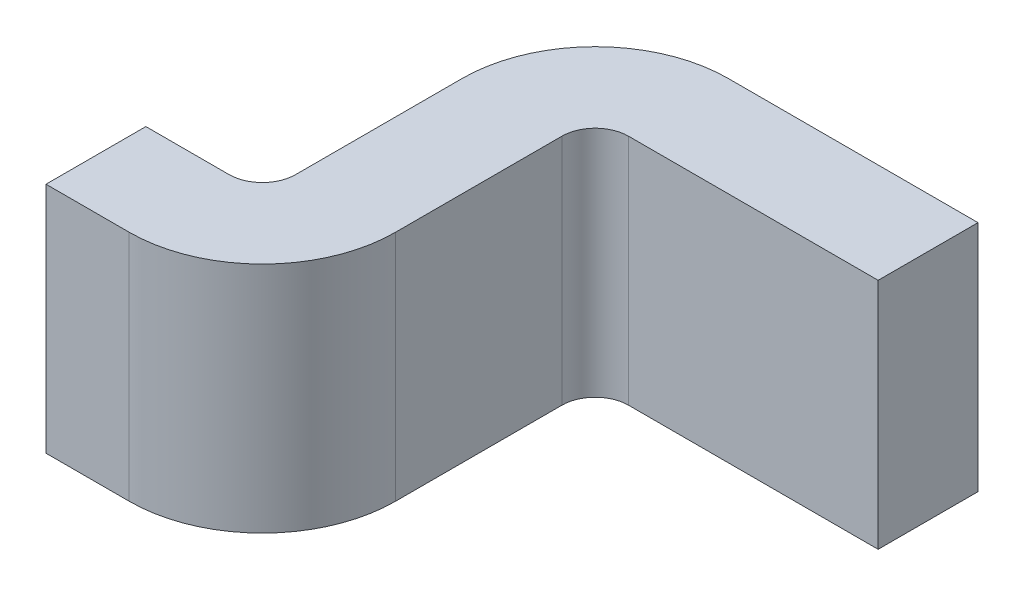
ISO-10303-21;
HEADER;
FILE_DESCRIPTION(('STEP AP214'),'2;1');
FILE_NAME('part.step','',(''),(''),'','','');
FILE_SCHEMA(('AUTOMOTIVE_DESIGN { 1 0 10303 214 1 1 1 1 }'));
ENDSEC;
DATA;
#1=APPLICATION_CONTEXT('core data for automotive mechanical design processes');
#2=APPLICATION_PROTOCOL_DEFINITION('international standard','automotive_design',2000,#1);
#3=PRODUCT_CONTEXT('',#1,'mechanical');
#4=PRODUCT('Part','Part','',(#3));
#5=PRODUCT_RELATED_PRODUCT_CATEGORY('part','',(#4));
#6=PRODUCT_DEFINITION_FORMATION('','',#4);
#7=PRODUCT_DEFINITION_CONTEXT('part definition',#1,'design');
#8=PRODUCT_DEFINITION('design','',#6,#7);
#9=PRODUCT_DEFINITION_SHAPE('','',#8);
#10=(LENGTH_UNIT() NAMED_UNIT(*) SI_UNIT(.MILLI.,.METRE.));
#11=(NAMED_UNIT(*) PLANE_ANGLE_UNIT() SI_UNIT($,.RADIAN.));
#12=(NAMED_UNIT(*) SI_UNIT($,.STERADIAN.) SOLID_ANGLE_UNIT());
#13=UNCERTAINTY_MEASURE_WITH_UNIT(LENGTH_MEASURE(1.E-05),#10,'distance_accuracy_value','');
#14=(GEOMETRIC_REPRESENTATION_CONTEXT(3) GLOBAL_UNCERTAINTY_ASSIGNED_CONTEXT((#13)) GLOBAL_UNIT_ASSIGNED_CONTEXT((#10,
#11,#12)) REPRESENTATION_CONTEXT('',''));
#15=CARTESIAN_POINT('',(0.,0.,0.));
#16=DIRECTION('',(0.,0.,1.));
#17=DIRECTION('',(1.,0.,0.));
#18=AXIS2_PLACEMENT_3D('',#15,#16,#17);
#19=CARTESIAN_POINT('',(4.075,-1.9082188291665,0.));
#20=DIRECTION('',(0.,1.,0.));
#21=DIRECTION('',(-1.,0.,0.));
#22=AXIS2_PLACEMENT_3D('',#19,#20,#21);
#23=PLANE('',#22);
#24=DIRECTION('',(-1.,0.,0.));
#25=VECTOR('',#24,1.);
#26=CARTESIAN_POINT('',(0.,-1.9082188291665,0.));
#27=LINE('',#26,#25);
#28=CARTESIAN_POINT('',(3.75,-1.9082188291665,0.));
#29=VERTEX_POINT('',#28);
#30=CARTESIAN_POINT('',(4.5,-1.9082188291665,0.));
#31=VERTEX_POINT('',#30);
#32=EDGE_CURVE('E134',#29,#31,#27,.F.);
#33=ORIENTED_EDGE('',*,*,#32,.F.);
#34=CARTESIAN_POINT('',(3.75,-1.9082188291665,0.4));
#35=DIRECTION('',(0.,-1.,0.));
#36=DIRECTION('',(1.,0.,0.));
#37=AXIS2_PLACEMENT_3D('',#34,#35,#36);
#38=CIRCLE('',#37,0.4);
#39=CARTESIAN_POINT('',(3.35,-1.9082188291665,0.4));
#40=VERTEX_POINT('',#39);
#41=EDGE_CURVE('E182',#40,#29,#38,.T.);
#42=ORIENTED_EDGE('',*,*,#41,.F.);
#43=DIRECTION('',(0.,0.,1.));
#44=VECTOR('',#43,1.);
#45=CARTESIAN_POINT('',(3.35,-1.9082188291665,0.));
#46=LINE('',#45,#44);
#47=CARTESIAN_POINT('',(3.35,-1.9082188291665,0.9));
#48=VERTEX_POINT('',#47);
#49=EDGE_CURVE('E140',#48,#40,#46,.F.);
#50=ORIENTED_EDGE('',*,*,#49,.F.);
#51=CARTESIAN_POINT('',(3.25,-1.9082188291665,0.9));
#52=DIRECTION('',(0.,1.,0.));
#53=DIRECTION('',(-1.,0.,0.));
#54=AXIS2_PLACEMENT_3D('',#51,#52,#53);
#55=CIRCLE('',#54,0.1);
#56=CARTESIAN_POINT('',(3.25,-1.9082188291665,1.));
#57=VERTEX_POINT('',#56);
#58=EDGE_CURVE('E185',#48,#57,#55,.F.);
#59=ORIENTED_EDGE('',*,*,#58,.T.);
#60=DIRECTION('',(1.,0.,0.));
#61=VECTOR('',#60,1.);
#62=CARTESIAN_POINT('',(3.5,-1.9082188291665,1.));
#63=LINE('',#62,#61);
#64=CARTESIAN_POINT('',(3.,-1.9082188291665,1.));
#65=VERTEX_POINT('',#64);
#66=EDGE_CURVE('E144',#57,#65,#63,.F.);
#67=ORIENTED_EDGE('',*,*,#66,.T.);
#68=DIRECTION('',(0.,0.,1.));
#69=VECTOR('',#68,1.);
#70=CARTESIAN_POINT('',(3.,-1.9082188291665,1.));
#71=LINE('',#70,#69);
#72=CARTESIAN_POINT('',(3.,-1.9082188291665,1.3));
#73=VERTEX_POINT('',#72);
#74=EDGE_CURVE('E148',#73,#65,#71,.F.);
#75=ORIENTED_EDGE('',*,*,#74,.F.);
#76=DIRECTION('',(1.,0.,0.));
#77=VECTOR('',#76,1.);
#78=CARTESIAN_POINT('',(3.65,-1.9082188291665,1.3));
#79=LINE('',#78,#77);
#80=CARTESIAN_POINT('',(3.25,-1.9082188291665,1.3));
#81=VERTEX_POINT('',#80);
#82=EDGE_CURVE('E156',#81,#73,#79,.F.);
#83=ORIENTED_EDGE('',*,*,#82,.F.);
#84=CARTESIAN_POINT('',(3.25,-1.9082188291665,0.9));
#85=DIRECTION('',(0.,-1.,0.));
#86=DIRECTION('',(1.,0.,0.));
#87=AXIS2_PLACEMENT_3D('',#84,#85,#86);
#88=CIRCLE('',#87,0.4);
#89=CARTESIAN_POINT('',(3.65,-1.9082188291665,0.9));
#90=VERTEX_POINT('',#89);
#91=EDGE_CURVE('E187',#90,#81,#88,.T.);
#92=ORIENTED_EDGE('',*,*,#91,.F.);
#93=DIRECTION('',(0.,0.,1.));
#94=VECTOR('',#93,1.);
#95=CARTESIAN_POINT('',(3.65,-1.9082188291665,0.15));
#96=LINE('',#95,#94);
#97=CARTESIAN_POINT('',(3.65,-1.9082188291665,0.4));
#98=VERTEX_POINT('',#97);
#99=EDGE_CURVE('E162',#90,#98,#96,.F.);
#100=ORIENTED_EDGE('',*,*,#99,.T.);
#101=CARTESIAN_POINT('',(3.75,-1.9082188291665,0.4));
#102=DIRECTION('',(0.,-1.,0.));
#103=DIRECTION('',(1.,0.,0.));
#104=AXIS2_PLACEMENT_3D('',#101,#102,#103);
#105=CIRCLE('',#104,0.1);
#106=CARTESIAN_POINT('',(3.75,-1.9082188291665,0.3));
#107=VERTEX_POINT('',#106);
#108=EDGE_CURVE('E20',#98,#107,#105,.T.);
#109=ORIENTED_EDGE('',*,*,#108,.T.);
#110=DIRECTION('',(-1.,0.,0.));
#111=VECTOR('',#110,1.);
#112=CARTESIAN_POINT('',(0.,-1.9082188291665,0.3));
#113=LINE('',#112,#111);
#114=CARTESIAN_POINT('',(4.5,-1.9082188291665,0.3));
#115=VERTEX_POINT('',#114);
#116=EDGE_CURVE('E92',#107,#115,#113,.F.);
#117=ORIENTED_EDGE('',*,*,#116,.T.);
#118=DIRECTION('',(0.,0.,1.));
#119=VECTOR('',#118,1.);
#120=CARTESIAN_POINT('',(4.5,-1.9082188291665,0.));
#121=LINE('',#120,#119);
#122=EDGE_CURVE('E112',#31,#115,#121,.T.);
#123=ORIENTED_EDGE('',*,*,#122,.F.);
#124=EDGE_LOOP('',(#33,#42,#50,#59,#67,#75,#83,#92,#100,#109,#117,#123));
#125=FACE_BOUND('',#124,.T.);
#126=ADVANCED_FACE('F17',(#125),#23,.T.);
#127=CARTESIAN_POINT('',(0.,-0.0164376583329882,0.));
#128=DIRECTION('',(0.,0.,-1.));
#129=DIRECTION('',(-1.,0.,0.));
#130=AXIS2_PLACEMENT_3D('',#127,#128,#129);
#131=PLANE('',#130);
#132=DIRECTION('',(0.,1.,0.));
#133=VECTOR('',#132,1.);
#134=CARTESIAN_POINT('',(4.5,-2.2582188291665,0.));
#135=LINE('',#134,#133);
#136=CARTESIAN_POINT('',(4.5,-2.6082188291665,0.));
#137=VERTEX_POINT('',#136);
#138=EDGE_CURVE('E101',#137,#31,#135,.T.);
#139=ORIENTED_EDGE('',*,*,#138,.F.);
#140=DIRECTION('',(1.,0.,0.));
#141=VECTOR('',#140,1.);
#142=CARTESIAN_POINT('',(4.075,-2.6082188291665,0.));
#143=LINE('',#142,#141);
#144=CARTESIAN_POINT('',(3.75,-2.6082188291665,0.));
#145=VERTEX_POINT('',#144);
#146=EDGE_CURVE('E125',#145,#137,#143,.T.);
#147=ORIENTED_EDGE('',*,*,#146,.F.);
#148=DIRECTION('',(0.,1.,0.));
#149=VECTOR('',#148,1.);
#150=CARTESIAN_POINT('',(3.75,-0.0164376583329882,0.));
#151=LINE('',#150,#149);
#152=EDGE_CURVE('E137',#145,#29,#151,.T.);
#153=ORIENTED_EDGE('',*,*,#152,.T.);
#154=ORIENTED_EDGE('',*,*,#32,.T.);
#155=EDGE_LOOP('',(#139,#147,#153,#154));
#156=FACE_BOUND('',#155,.T.);
#157=ADVANCED_FACE('F381',(#156),#131,.T.);
#158=CARTESIAN_POINT('',(4.5,-2.2582188291665,0.));
#159=DIRECTION('',(1.,0.,0.));
#160=DIRECTION('',(0.,1.,0.));
#161=AXIS2_PLACEMENT_3D('',#158,#159,#160);
#162=PLANE('',#161);
#163=ORIENTED_EDGE('',*,*,#138,.T.);
#164=ORIENTED_EDGE('',*,*,#122,.T.);
#165=DIRECTION('',(0.,1.,0.));
#166=VECTOR('',#165,1.);
#167=CARTESIAN_POINT('',(4.5,-0.0164376583329882,0.3));
#168=LINE('',#167,#166);
#169=CARTESIAN_POINT('',(4.5,-2.6082188291665,0.3));
#170=VERTEX_POINT('',#169);
#171=EDGE_CURVE('E106',#115,#170,#168,.F.);
#172=ORIENTED_EDGE('',*,*,#171,.T.);
#173=DIRECTION('',(0.,0.,1.));
#174=VECTOR('',#173,1.);
#175=CARTESIAN_POINT('',(4.5,-2.6082188291665,0.));
#176=LINE('',#175,#174);
#177=EDGE_CURVE('E110',#137,#170,#176,.T.);
#178=ORIENTED_EDGE('',*,*,#177,.F.);
#179=EDGE_LOOP('',(#163,#164,#172,#178));
#180=FACE_BOUND('',#179,.T.);
#181=ADVANCED_FACE('F108',(#180),#162,.T.);
#182=CARTESIAN_POINT('',(0.,-0.0164376583329882,0.3));
#183=DIRECTION('',(0.,0.,-1.));
#184=DIRECTION('',(-1.,0.,0.));
#185=AXIS2_PLACEMENT_3D('',#182,#183,#184);
#186=PLANE('',#185);
#187=DIRECTION('',(1.,0.,0.));
#188=VECTOR('',#187,1.);
#189=CARTESIAN_POINT('',(4.075,-2.6082188291665,0.3));
#190=LINE('',#189,#188);
#191=CARTESIAN_POINT('',(3.75,-2.6082188291665,0.3));
#192=VERTEX_POINT('',#191);
#193=EDGE_CURVE('E117',#170,#192,#190,.F.);
#194=ORIENTED_EDGE('',*,*,#193,.F.);
#195=ORIENTED_EDGE('',*,*,#171,.F.);
#196=ORIENTED_EDGE('',*,*,#116,.F.);
#197=DIRECTION('',(0.,-1.,0.));
#198=VECTOR('',#197,1.);
#199=CARTESIAN_POINT('',(3.75,-1.13732824374975,0.3));
#200=LINE('',#199,#198);
#201=EDGE_CURVE('E114',#107,#192,#200,.T.);
#202=ORIENTED_EDGE('',*,*,#201,.T.);
#203=EDGE_LOOP('',(#194,#195,#196,#202));
#204=FACE_BOUND('',#203,.T.);
#205=ADVANCED_FACE('F118',(#204),#186,.F.);
#206=CARTESIAN_POINT('',(3.75,-1.13732824374975,0.4));
#207=DIRECTION('',(0.,-1.,0.));
#208=DIRECTION('',(1.,0.,0.));
#209=AXIS2_PLACEMENT_3D('',#206,#207,#208);
#210=CYLINDRICAL_SURFACE('',#209,0.1);
#211=ORIENTED_EDGE('',*,*,#108,.F.);
#212=DIRECTION('',(0.,-1.,0.));
#213=VECTOR('',#212,1.);
#214=CARTESIAN_POINT('',(3.65,-2.2582188291665,0.4));
#215=LINE('',#214,#213);
#216=CARTESIAN_POINT('',(3.65,-2.6082188291665,0.4));
#217=VERTEX_POINT('',#216);
#218=EDGE_CURVE('E164',#98,#217,#215,.T.);
#219=ORIENTED_EDGE('',*,*,#218,.T.);
#220=CARTESIAN_POINT('',(3.75,-2.6082188291665,0.4));
#221=DIRECTION('',(0.,-1.,0.));
#222=DIRECTION('',(1.,0.,0.));
#223=AXIS2_PLACEMENT_3D('',#220,#221,#222);
#224=CIRCLE('',#223,0.1);
#225=EDGE_CURVE('E122',#192,#217,#224,.F.);
#226=ORIENTED_EDGE('',*,*,#225,.F.);
#227=ORIENTED_EDGE('',*,*,#201,.F.);
#228=EDGE_LOOP('',(#211,#219,#226,#227));
#229=FACE_BOUND('',#228,.T.);
#230=ADVANCED_FACE('F262',(#229),#210,.F.);
#231=CARTESIAN_POINT('',(3.65,-2.2582188291665,0.15));
#232=DIRECTION('',(-1.,0.,0.));
#233=DIRECTION('',(0.,-1.,0.));
#234=AXIS2_PLACEMENT_3D('',#231,#232,#233);
#235=PLANE('',#234);
#236=ORIENTED_EDGE('',*,*,#99,.F.);
#237=DIRECTION('',(0.,-1.,0.));
#238=VECTOR('',#237,1.);
#239=CARTESIAN_POINT('',(3.65,-2.2582188291665,0.9));
#240=LINE('',#239,#238);
#241=CARTESIAN_POINT('',(3.65,-2.6082188291665,0.9));
#242=VERTEX_POINT('',#241);
#243=EDGE_CURVE('E188',#242,#90,#240,.F.);
#244=ORIENTED_EDGE('',*,*,#243,.F.);
#245=DIRECTION('',(0.,0.,1.));
#246=VECTOR('',#245,1.);
#247=CARTESIAN_POINT('',(3.65,-2.6082188291665,0.));
#248=LINE('',#247,#246);
#249=EDGE_CURVE('E179',#217,#242,#248,.T.);
#250=ORIENTED_EDGE('',*,*,#249,.F.);
#251=ORIENTED_EDGE('',*,*,#218,.F.);
#252=EDGE_LOOP('',(#236,#244,#250,#251));
#253=FACE_BOUND('',#252,.T.);
#254=ADVANCED_FACE('F254',(#253),#235,.F.);
#255=CARTESIAN_POINT('',(3.25,-2.2582188291665,0.9));
#256=DIRECTION('',(0.,-1.,0.));
#257=DIRECTION('',(1.,0.,0.));
#258=AXIS2_PLACEMENT_3D('',#255,#256,#257);
#259=CYLINDRICAL_SURFACE('',#258,0.4);
#260=DIRECTION('',(0.,1.,0.));
#261=VECTOR('',#260,1.);
#262=CARTESIAN_POINT('',(3.25,-2.2582188291665,1.3));
#263=LINE('',#262,#261);
#264=CARTESIAN_POINT('',(3.25,-2.6082188291665,1.3));
#265=VERTEX_POINT('',#264);
#266=EDGE_CURVE('E159',#265,#81,#263,.T.);
#267=ORIENTED_EDGE('',*,*,#266,.F.);
#268=CARTESIAN_POINT('',(3.25,-2.6082188291665,0.9));
#269=DIRECTION('',(0.,-1.,0.));
#270=DIRECTION('',(1.,0.,0.));
#271=AXIS2_PLACEMENT_3D('',#268,#269,#270);
#272=CIRCLE('',#271,0.4);
#273=EDGE_CURVE('E176',#242,#265,#272,.T.);
#274=ORIENTED_EDGE('',*,*,#273,.F.);
#275=ORIENTED_EDGE('',*,*,#243,.T.);
#276=ORIENTED_EDGE('',*,*,#91,.T.);
#277=EDGE_LOOP('',(#267,#274,#275,#276));
#278=FACE_BOUND('',#277,.T.);
#279=ADVANCED_FACE('F252',(#278),#259,.T.);
#280=CARTESIAN_POINT('',(3.65,-2.2582188291665,1.3));
#281=DIRECTION('',(0.,0.,1.));
#282=DIRECTION('',(1.,0.,0.));
#283=AXIS2_PLACEMENT_3D('',#280,#281,#282);
#284=PLANE('',#283);
#285=DIRECTION('',(0.,-1.,0.));
#286=VECTOR('',#285,1.);
#287=CARTESIAN_POINT('',(3.,-2.2582188291665,1.3));
#288=LINE('',#287,#286);
#289=CARTESIAN_POINT('',(3.,-2.6082188291665,1.3));
#290=VERTEX_POINT('',#289);
#291=EDGE_CURVE('E153',#290,#73,#288,.F.);
#292=ORIENTED_EDGE('',*,*,#291,.F.);
#293=DIRECTION('',(1.,0.,0.));
#294=VECTOR('',#293,1.);
#295=CARTESIAN_POINT('',(4.075,-2.6082188291665,1.3));
#296=LINE('',#295,#294);
#297=EDGE_CURVE('E178',#265,#290,#296,.F.);
#298=ORIENTED_EDGE('',*,*,#297,.F.);
#299=ORIENTED_EDGE('',*,*,#266,.T.);
#300=ORIENTED_EDGE('',*,*,#82,.T.);
#301=EDGE_LOOP('',(#292,#298,#299,#300));
#302=FACE_BOUND('',#301,.T.);
#303=ADVANCED_FACE('F247',(#302),#284,.T.);
#304=CARTESIAN_POINT('',(3.,-2.2582188291665,1.));
#305=DIRECTION('',(-1.,0.,0.));
#306=DIRECTION('',(0.,-1.,0.));
#307=AXIS2_PLACEMENT_3D('',#304,#305,#306);
#308=PLANE('',#307);
#309=DIRECTION('',(0.,1.,0.));
#310=VECTOR('',#309,1.);
#311=CARTESIAN_POINT('',(3.,-2.2582188291665,1.));
#312=LINE('',#311,#310);
#313=CARTESIAN_POINT('',(3.,-2.6082188291665,1.));
#314=VERTEX_POINT('',#313);
#315=EDGE_CURVE('E147',#65,#314,#312,.F.);
#316=ORIENTED_EDGE('',*,*,#315,.T.);
#317=DIRECTION('',(0.,0.,1.));
#318=VECTOR('',#317,1.);
#319=CARTESIAN_POINT('',(3.,-2.6082188291665,0.));
#320=LINE('',#319,#318);
#321=EDGE_CURVE('E207',#290,#314,#320,.F.);
#322=ORIENTED_EDGE('',*,*,#321,.F.);
#323=ORIENTED_EDGE('',*,*,#291,.T.);
#324=ORIENTED_EDGE('',*,*,#74,.T.);
#325=EDGE_LOOP('',(#316,#322,#323,#324));
#326=FACE_BOUND('',#325,.T.);
#327=ADVANCED_FACE('F250',(#326),#308,.T.);
#328=CARTESIAN_POINT('',(3.5,-2.2582188291665,1.));
#329=DIRECTION('',(0.,0.,1.));
#330=DIRECTION('',(1.,0.,0.));
#331=AXIS2_PLACEMENT_3D('',#328,#329,#330);
#332=PLANE('',#331);
#333=DIRECTION('',(1.,0.,0.));
#334=VECTOR('',#333,1.);
#335=CARTESIAN_POINT('',(4.075,-2.6082188291665,1.));
#336=LINE('',#335,#334);
#337=CARTESIAN_POINT('',(3.25,-2.6082188291665,1.));
#338=VERTEX_POINT('',#337);
#339=EDGE_CURVE('E175',#314,#338,#336,.T.);
#340=ORIENTED_EDGE('',*,*,#339,.F.);
#341=ORIENTED_EDGE('',*,*,#315,.F.);
#342=ORIENTED_EDGE('',*,*,#66,.F.);
#343=DIRECTION('',(0.,1.,0.));
#344=VECTOR('',#343,1.);
#345=CARTESIAN_POINT('',(3.25,-2.2582188291665,1.));
#346=LINE('',#345,#344);
#347=EDGE_CURVE('E186',#57,#338,#346,.F.);
#348=ORIENTED_EDGE('',*,*,#347,.T.);
#349=EDGE_LOOP('',(#340,#341,#342,#348));
#350=FACE_BOUND('',#349,.T.);
#351=ADVANCED_FACE('F237',(#350),#332,.F.);
#352=CARTESIAN_POINT('',(3.25,-2.2582188291665,0.9));
#353=DIRECTION('',(0.,1.,0.));
#354=DIRECTION('',(-1.,0.,0.));
#355=AXIS2_PLACEMENT_3D('',#352,#353,#354);
#356=CYLINDRICAL_SURFACE('',#355,0.1);
#357=ORIENTED_EDGE('',*,*,#58,.F.);
#358=DIRECTION('',(0.,-1.,0.));
#359=VECTOR('',#358,1.);
#360=CARTESIAN_POINT('',(3.35,-2.2582188291665,0.9));
#361=LINE('',#360,#359);
#362=CARTESIAN_POINT('',(3.35,-2.6082188291665,0.9));
#363=VERTEX_POINT('',#362);
#364=EDGE_CURVE('E143',#363,#48,#361,.F.);
#365=ORIENTED_EDGE('',*,*,#364,.F.);
#366=CARTESIAN_POINT('',(3.25,-2.6082188291665,0.9));
#367=DIRECTION('',(0.,1.,0.));
#368=DIRECTION('',(-1.,0.,0.));
#369=AXIS2_PLACEMENT_3D('',#366,#367,#368);
#370=CIRCLE('',#369,0.1);
#371=EDGE_CURVE('E26',#338,#363,#370,.T.);
#372=ORIENTED_EDGE('',*,*,#371,.F.);
#373=ORIENTED_EDGE('',*,*,#347,.F.);
#374=EDGE_LOOP('',(#357,#365,#372,#373));
#375=FACE_BOUND('',#374,.T.);
#376=ADVANCED_FACE('F276',(#375),#356,.F.);
#377=CARTESIAN_POINT('',(3.35,-2.2582188291665,0.));
#378=DIRECTION('',(-1.,0.,0.));
#379=DIRECTION('',(0.,-1.,0.));
#380=AXIS2_PLACEMENT_3D('',#377,#378,#379);
#381=PLANE('',#380);
#382=ORIENTED_EDGE('',*,*,#364,.T.);
#383=ORIENTED_EDGE('',*,*,#49,.T.);
#384=DIRECTION('',(0.,-1.,0.));
#385=VECTOR('',#384,1.);
#386=CARTESIAN_POINT('',(3.35,-1.13732824374975,0.4));
#387=LINE('',#386,#385);
#388=CARTESIAN_POINT('',(3.35,-2.6082188291665,0.4));
#389=VERTEX_POINT('',#388);
#390=EDGE_CURVE('E142',#389,#40,#387,.F.);
#391=ORIENTED_EDGE('',*,*,#390,.F.);
#392=DIRECTION('',(0.,0.,1.));
#393=VECTOR('',#392,1.);
#394=CARTESIAN_POINT('',(3.35,-2.6082188291665,0.));
#395=LINE('',#394,#393);
#396=EDGE_CURVE('E11',#363,#389,#395,.F.);
#397=ORIENTED_EDGE('',*,*,#396,.F.);
#398=EDGE_LOOP('',(#382,#383,#391,#397));
#399=FACE_BOUND('',#398,.T.);
#400=ADVANCED_FACE('F271',(#399),#381,.T.);
#401=CARTESIAN_POINT('',(3.75,-1.13732824374975,0.4));
#402=DIRECTION('',(0.,-1.,0.));
#403=DIRECTION('',(1.,0.,0.));
#404=AXIS2_PLACEMENT_3D('',#401,#402,#403);
#405=CYLINDRICAL_SURFACE('',#404,0.4);
#406=ORIENTED_EDGE('',*,*,#390,.T.);
#407=ORIENTED_EDGE('',*,*,#41,.T.);
#408=ORIENTED_EDGE('',*,*,#152,.F.);
#409=CARTESIAN_POINT('',(3.75,-2.6082188291665,0.4));
#410=DIRECTION('',(0.,-1.,0.));
#411=DIRECTION('',(1.,0.,0.));
#412=AXIS2_PLACEMENT_3D('',#409,#410,#411);
#413=CIRCLE('',#412,0.4);
#414=EDGE_CURVE('E35',#389,#145,#413,.T.);
#415=ORIENTED_EDGE('',*,*,#414,.F.);
#416=EDGE_LOOP('',(#406,#407,#408,#415));
#417=FACE_BOUND('',#416,.T.);
#418=ADVANCED_FACE('F266',(#417),#405,.T.);
#419=CARTESIAN_POINT('',(4.075,-2.6082188291665,0.));
#420=DIRECTION('',(0.,-1.,0.));
#421=DIRECTION('',(1.,0.,0.));
#422=AXIS2_PLACEMENT_3D('',#419,#420,#421);
#423=PLANE('',#422);
#424=ORIENTED_EDGE('',*,*,#396,.T.);
#425=ORIENTED_EDGE('',*,*,#414,.T.);
#426=ORIENTED_EDGE('',*,*,#146,.T.);
#427=ORIENTED_EDGE('',*,*,#177,.T.);
#428=ORIENTED_EDGE('',*,*,#193,.T.);
#429=ORIENTED_EDGE('',*,*,#225,.T.);
#430=ORIENTED_EDGE('',*,*,#249,.T.);
#431=ORIENTED_EDGE('',*,*,#273,.T.);
#432=ORIENTED_EDGE('',*,*,#297,.T.);
#433=ORIENTED_EDGE('',*,*,#321,.T.);
#434=ORIENTED_EDGE('',*,*,#339,.T.);
#435=ORIENTED_EDGE('',*,*,#371,.T.);
#436=EDGE_LOOP('',(#424,#425,#426,#427,#428,#429,#430,#431,#432,#433,#434,#435));
#437=FACE_BOUND('',#436,.T.);
#438=ADVANCED_FACE('F124',(#437),#423,.T.);
#439=CLOSED_SHELL('',(#126,#157,#181,#205,#230,#254,#279,#303,#327,#351,#376,#400,#418,#438));
#440=MANIFOLD_SOLID_BREP('B1',#439);
#441=ADVANCED_BREP_SHAPE_REPRESENTATION('',(#18,#440),#14);
#442=SHAPE_DEFINITION_REPRESENTATION(#9,#441);
ENDSEC;
END-ISO-10303-21;
